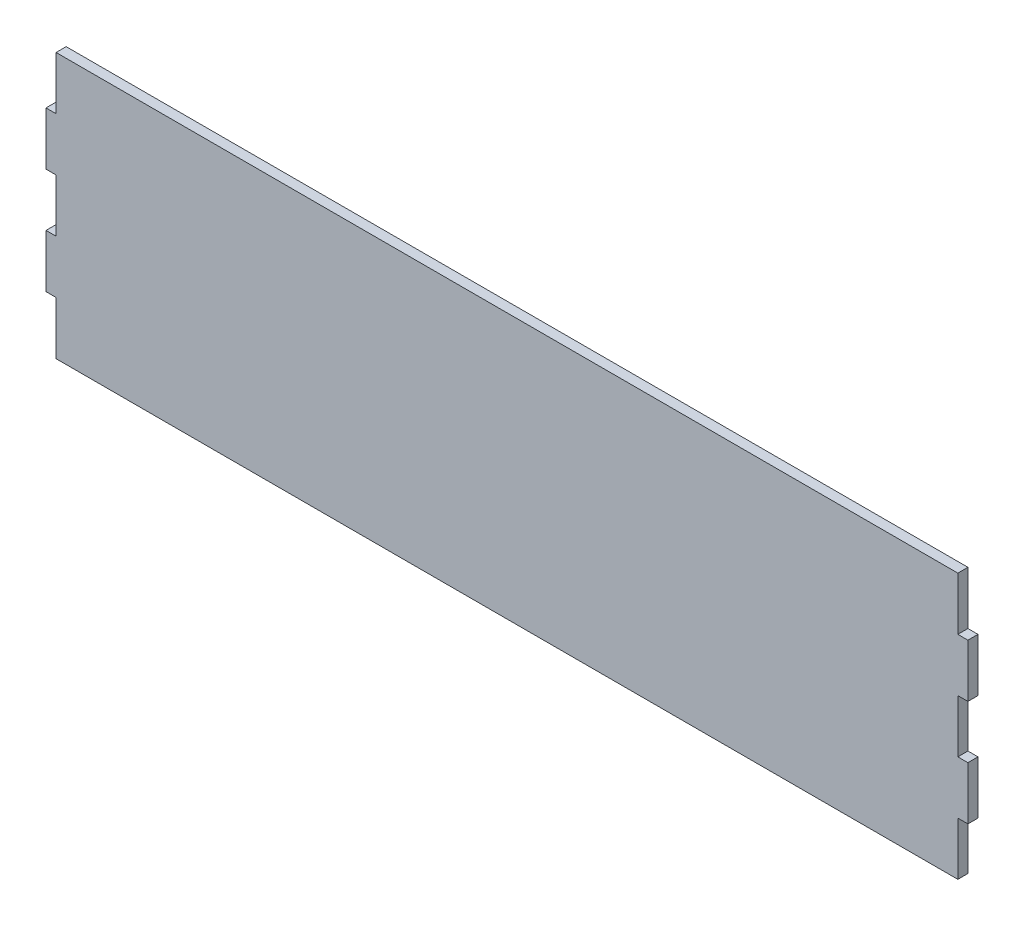
ISO-10303-21;
HEADER;
FILE_DESCRIPTION(('STEP AP214'),'2;1');
FILE_NAME('part.step','',(''),(''),'','','');
FILE_SCHEMA(('AUTOMOTIVE_DESIGN { 1 0 10303 214 1 1 1 1 }'));
ENDSEC;
DATA;
#1=APPLICATION_CONTEXT('core data for automotive mechanical design processes');
#2=APPLICATION_PROTOCOL_DEFINITION('international standard','automotive_design',2000,#1);
#3=PRODUCT_CONTEXT('',#1,'mechanical');
#4=PRODUCT('Part','Part','',(#3));
#5=PRODUCT_RELATED_PRODUCT_CATEGORY('part','',(#4));
#6=PRODUCT_DEFINITION_FORMATION('','',#4);
#7=PRODUCT_DEFINITION_CONTEXT('part definition',#1,'design');
#8=PRODUCT_DEFINITION('design','',#6,#7);
#9=PRODUCT_DEFINITION_SHAPE('','',#8);
#10=(LENGTH_UNIT() NAMED_UNIT(*) SI_UNIT(.MILLI.,.METRE.));
#11=(NAMED_UNIT(*) PLANE_ANGLE_UNIT() SI_UNIT($,.RADIAN.));
#12=(NAMED_UNIT(*) SI_UNIT($,.STERADIAN.) SOLID_ANGLE_UNIT());
#13=UNCERTAINTY_MEASURE_WITH_UNIT(LENGTH_MEASURE(1.E-05),#10,'distance_accuracy_value','');
#14=(GEOMETRIC_REPRESENTATION_CONTEXT(3) GLOBAL_UNCERTAINTY_ASSIGNED_CONTEXT((#13)) GLOBAL_UNIT_ASSIGNED_CONTEXT((#10,
#11,#12)) REPRESENTATION_CONTEXT('',''));
#15=CARTESIAN_POINT('',(0.,0.,0.));
#16=DIRECTION('',(0.,0.,1.));
#17=DIRECTION('',(1.,0.,0.));
#18=AXIS2_PLACEMENT_3D('',#15,#16,#17);
#19=CARTESIAN_POINT('',(0.,127.,4.826));
#20=DIRECTION('',(1.,0.,0.));
#21=DIRECTION('',(0.,0.,-1.));
#22=AXIS2_PLACEMENT_3D('',#19,#20,#21);
#23=PLANE('',#22);
#24=DIRECTION('',(0.,-1.,0.));
#25=VECTOR('',#24,1.);
#26=CARTESIAN_POINT('',(0.,127.,0.));
#27=LINE('',#26,#25);
#28=CARTESIAN_POINT('',(0.,127.,0.));
#29=VERTEX_POINT('',#28);
#30=CARTESIAN_POINT('',(0.,101.6,0.));
#31=VERTEX_POINT('',#30);
#32=EDGE_CURVE('E203',#29,#31,#27,.T.);
#33=ORIENTED_EDGE('',*,*,#32,.T.);
#34=DIRECTION('',(0.,0.,-1.));
#35=VECTOR('',#34,1.);
#36=CARTESIAN_POINT('',(0.,101.6,4.826));
#37=LINE('',#36,#35);
#38=CARTESIAN_POINT('',(0.,101.6,4.826));
#39=VERTEX_POINT('',#38);
#40=EDGE_CURVE('E11',#39,#31,#37,.T.);
#41=ORIENTED_EDGE('',*,*,#40,.F.);
#42=DIRECTION('',(0.,-1.,0.));
#43=VECTOR('',#42,1.);
#44=CARTESIAN_POINT('',(0.,127.,4.826));
#45=LINE('',#44,#43);
#46=CARTESIAN_POINT('',(0.,127.,4.826));
#47=VERTEX_POINT('',#46);
#48=EDGE_CURVE('E241',#47,#39,#45,.T.);
#49=ORIENTED_EDGE('',*,*,#48,.F.);
#50=DIRECTION('',(0.,0.,-1.));
#51=VECTOR('',#50,1.);
#52=CARTESIAN_POINT('',(0.,127.,4.826));
#53=LINE('',#52,#51);
#54=EDGE_CURVE('E199',#47,#29,#53,.T.);
#55=ORIENTED_EDGE('',*,*,#54,.T.);
#56=EDGE_LOOP('',(#33,#41,#49,#55));
#57=FACE_BOUND('',#56,.T.);
#58=ADVANCED_FACE('F35',(#57),#23,.F.);
#59=CARTESIAN_POINT('',(0.,101.6,4.826));
#60=DIRECTION('',(0.,-1.,0.));
#61=DIRECTION('',(1.,0.,0.));
#62=AXIS2_PLACEMENT_3D('',#59,#60,#61);
#63=PLANE('',#62);
#64=DIRECTION('',(-1.,0.,0.));
#65=VECTOR('',#64,1.);
#66=CARTESIAN_POINT('',(0.,101.6,0.));
#67=LINE('',#66,#65);
#68=CARTESIAN_POINT('',(-4.826,101.6,0.));
#69=VERTEX_POINT('',#68);
#70=EDGE_CURVE('E206',#31,#69,#67,.T.);
#71=ORIENTED_EDGE('',*,*,#70,.T.);
#72=DIRECTION('',(0.,0.,-1.));
#73=VECTOR('',#72,1.);
#74=CARTESIAN_POINT('',(-4.826,101.6,4.826));
#75=LINE('',#74,#73);
#76=CARTESIAN_POINT('',(-4.826,101.6,4.826));
#77=VERTEX_POINT('',#76);
#78=EDGE_CURVE('E43',#77,#69,#75,.T.);
#79=ORIENTED_EDGE('',*,*,#78,.F.);
#80=DIRECTION('',(-1.,0.,0.));
#81=VECTOR('',#80,1.);
#82=CARTESIAN_POINT('',(0.,101.6,4.826));
#83=LINE('',#82,#81);
#84=EDGE_CURVE('E130',#39,#77,#83,.T.);
#85=ORIENTED_EDGE('',*,*,#84,.F.);
#86=ORIENTED_EDGE('',*,*,#40,.T.);
#87=EDGE_LOOP('',(#71,#79,#85,#86));
#88=FACE_BOUND('',#87,.T.);
#89=ADVANCED_FACE('F359',(#88),#63,.F.);
#90=CARTESIAN_POINT('',(-4.826,101.6,4.826));
#91=DIRECTION('',(1.,0.,0.));
#92=DIRECTION('',(0.,1.,0.));
#93=AXIS2_PLACEMENT_3D('',#90,#91,#92);
#94=PLANE('',#93);
#95=DIRECTION('',(0.,-1.,0.));
#96=VECTOR('',#95,1.);
#97=CARTESIAN_POINT('',(-4.826,101.6,0.));
#98=LINE('',#97,#96);
#99=CARTESIAN_POINT('',(-4.826,76.2,0.));
#100=VERTEX_POINT('',#99);
#101=EDGE_CURVE('E208',#69,#100,#98,.T.);
#102=ORIENTED_EDGE('',*,*,#101,.T.);
#103=DIRECTION('',(0.,0.,-1.));
#104=VECTOR('',#103,1.);
#105=CARTESIAN_POINT('',(-4.826,76.2,4.826));
#106=LINE('',#105,#104);
#107=CARTESIAN_POINT('',(-4.826,76.2,4.826));
#108=VERTEX_POINT('',#107);
#109=EDGE_CURVE('E284',#108,#100,#106,.T.);
#110=ORIENTED_EDGE('',*,*,#109,.F.);
#111=DIRECTION('',(0.,-1.,0.));
#112=VECTOR('',#111,1.);
#113=CARTESIAN_POINT('',(-4.826,101.6,4.826));
#114=LINE('',#113,#112);
#115=EDGE_CURVE('E292',#77,#108,#114,.T.);
#116=ORIENTED_EDGE('',*,*,#115,.F.);
#117=ORIENTED_EDGE('',*,*,#78,.T.);
#118=EDGE_LOOP('',(#102,#110,#116,#117));
#119=FACE_BOUND('',#118,.T.);
#120=ADVANCED_FACE('F290',(#119),#94,.F.);
#121=CARTESIAN_POINT('',(0.,76.2,4.826));
#122=DIRECTION('',(0.,1.,0.));
#123=DIRECTION('',(0.,0.,1.));
#124=AXIS2_PLACEMENT_3D('',#121,#122,#123);
#125=PLANE('',#124);
#126=DIRECTION('',(1.,0.,0.));
#127=VECTOR('',#126,1.);
#128=CARTESIAN_POINT('',(0.,76.2,0.));
#129=LINE('',#128,#127);
#130=CARTESIAN_POINT('',(0.,76.2,0.));
#131=VERTEX_POINT('',#130);
#132=EDGE_CURVE('E210',#100,#131,#129,.T.);
#133=ORIENTED_EDGE('',*,*,#132,.T.);
#134=DIRECTION('',(0.,0.,-1.));
#135=VECTOR('',#134,1.);
#136=CARTESIAN_POINT('',(0.,76.2,4.826));
#137=LINE('',#136,#135);
#138=CARTESIAN_POINT('',(0.,76.2,4.826));
#139=VERTEX_POINT('',#138);
#140=EDGE_CURVE('E281',#139,#131,#137,.T.);
#141=ORIENTED_EDGE('',*,*,#140,.F.);
#142=DIRECTION('',(1.,0.,0.));
#143=VECTOR('',#142,1.);
#144=CARTESIAN_POINT('',(0.,76.2,4.826));
#145=LINE('',#144,#143);
#146=EDGE_CURVE('E310',#108,#139,#145,.T.);
#147=ORIENTED_EDGE('',*,*,#146,.F.);
#148=ORIENTED_EDGE('',*,*,#109,.T.);
#149=EDGE_LOOP('',(#133,#141,#147,#148));
#150=FACE_BOUND('',#149,.T.);
#151=ADVANCED_FACE('F301',(#150),#125,.F.);
#152=CARTESIAN_POINT('',(0.,76.2,4.826));
#153=DIRECTION('',(1.,0.,0.));
#154=DIRECTION('',(0.,0.,-1.));
#155=AXIS2_PLACEMENT_3D('',#152,#153,#154);
#156=PLANE('',#155);
#157=DIRECTION('',(0.,-1.,0.));
#158=VECTOR('',#157,1.);
#159=CARTESIAN_POINT('',(0.,76.2,0.));
#160=LINE('',#159,#158);
#161=CARTESIAN_POINT('',(0.,50.8,0.));
#162=VERTEX_POINT('',#161);
#163=EDGE_CURVE('E212',#131,#162,#160,.T.);
#164=ORIENTED_EDGE('',*,*,#163,.T.);
#165=DIRECTION('',(0.,0.,-1.));
#166=VECTOR('',#165,1.);
#167=CARTESIAN_POINT('',(0.,50.8,4.826));
#168=LINE('',#167,#166);
#169=CARTESIAN_POINT('',(0.,50.8,4.826));
#170=VERTEX_POINT('',#169);
#171=EDGE_CURVE('E278',#170,#162,#168,.T.);
#172=ORIENTED_EDGE('',*,*,#171,.F.);
#173=DIRECTION('',(0.,-1.,0.));
#174=VECTOR('',#173,1.);
#175=CARTESIAN_POINT('',(0.,76.2,4.826));
#176=LINE('',#175,#174);
#177=EDGE_CURVE('E307',#139,#170,#176,.T.);
#178=ORIENTED_EDGE('',*,*,#177,.F.);
#179=ORIENTED_EDGE('',*,*,#140,.T.);
#180=EDGE_LOOP('',(#164,#172,#178,#179));
#181=FACE_BOUND('',#180,.T.);
#182=ADVANCED_FACE('F305',(#181),#156,.F.);
#183=CARTESIAN_POINT('',(0.,50.8,4.826));
#184=DIRECTION('',(0.,-1.,0.));
#185=DIRECTION('',(0.,0.,-1.));
#186=AXIS2_PLACEMENT_3D('',#183,#184,#185);
#187=PLANE('',#186);
#188=DIRECTION('',(-1.,0.,0.));
#189=VECTOR('',#188,1.);
#190=CARTESIAN_POINT('',(0.,50.8,0.));
#191=LINE('',#190,#189);
#192=CARTESIAN_POINT('',(-4.826,50.8,0.));
#193=VERTEX_POINT('',#192);
#194=EDGE_CURVE('E214',#162,#193,#191,.T.);
#195=ORIENTED_EDGE('',*,*,#194,.T.);
#196=DIRECTION('',(0.,0.,-1.));
#197=VECTOR('',#196,1.);
#198=CARTESIAN_POINT('',(-4.826,50.8,4.826));
#199=LINE('',#198,#197);
#200=CARTESIAN_POINT('',(-4.826,50.8,4.826));
#201=VERTEX_POINT('',#200);
#202=EDGE_CURVE('E275',#201,#193,#199,.T.);
#203=ORIENTED_EDGE('',*,*,#202,.F.);
#204=DIRECTION('',(-1.,0.,0.));
#205=VECTOR('',#204,1.);
#206=CARTESIAN_POINT('',(0.,50.8,4.826));
#207=LINE('',#206,#205);
#208=EDGE_CURVE('E309',#170,#201,#207,.T.);
#209=ORIENTED_EDGE('',*,*,#208,.F.);
#210=ORIENTED_EDGE('',*,*,#171,.T.);
#211=EDGE_LOOP('',(#195,#203,#209,#210));
#212=FACE_BOUND('',#211,.T.);
#213=ADVANCED_FACE('F372',(#212),#187,.F.);
#214=CARTESIAN_POINT('',(-4.826,50.8,4.826));
#215=DIRECTION('',(1.,0.,0.));
#216=DIRECTION('',(0.,0.,-1.));
#217=AXIS2_PLACEMENT_3D('',#214,#215,#216);
#218=PLANE('',#217);
#219=DIRECTION('',(0.,-1.,0.));
#220=VECTOR('',#219,1.);
#221=CARTESIAN_POINT('',(-4.826,50.8,0.));
#222=LINE('',#221,#220);
#223=CARTESIAN_POINT('',(-4.826,25.4,0.));
#224=VERTEX_POINT('',#223);
#225=EDGE_CURVE('E216',#193,#224,#222,.T.);
#226=ORIENTED_EDGE('',*,*,#225,.T.);
#227=DIRECTION('',(0.,0.,-1.));
#228=VECTOR('',#227,1.);
#229=CARTESIAN_POINT('',(-4.826,25.4,4.826));
#230=LINE('',#229,#228);
#231=CARTESIAN_POINT('',(-4.826,25.4,4.826));
#232=VERTEX_POINT('',#231);
#233=EDGE_CURVE('E272',#232,#224,#230,.T.);
#234=ORIENTED_EDGE('',*,*,#233,.F.);
#235=DIRECTION('',(0.,-1.,0.));
#236=VECTOR('',#235,1.);
#237=CARTESIAN_POINT('',(-4.826,50.8,4.826));
#238=LINE('',#237,#236);
#239=EDGE_CURVE('E312',#201,#232,#238,.T.);
#240=ORIENTED_EDGE('',*,*,#239,.F.);
#241=ORIENTED_EDGE('',*,*,#202,.T.);
#242=EDGE_LOOP('',(#226,#234,#240,#241));
#243=FACE_BOUND('',#242,.T.);
#244=ADVANCED_FACE('F375',(#243),#218,.F.);
#245=CARTESIAN_POINT('',(0.,25.4,4.826));
#246=DIRECTION('',(0.,1.,0.));
#247=DIRECTION('',(-1.,0.,0.));
#248=AXIS2_PLACEMENT_3D('',#245,#246,#247);
#249=PLANE('',#248);
#250=DIRECTION('',(1.,0.,0.));
#251=VECTOR('',#250,1.);
#252=CARTESIAN_POINT('',(0.,25.4,0.));
#253=LINE('',#252,#251);
#254=CARTESIAN_POINT('',(0.,25.4,0.));
#255=VERTEX_POINT('',#254);
#256=EDGE_CURVE('E218',#224,#255,#253,.T.);
#257=ORIENTED_EDGE('',*,*,#256,.T.);
#258=DIRECTION('',(0.,0.,-1.));
#259=VECTOR('',#258,1.);
#260=CARTESIAN_POINT('',(0.,25.4,4.826));
#261=LINE('',#260,#259);
#262=CARTESIAN_POINT('',(0.,25.4,4.826));
#263=VERTEX_POINT('',#262);
#264=EDGE_CURVE('E269',#263,#255,#261,.T.);
#265=ORIENTED_EDGE('',*,*,#264,.F.);
#266=DIRECTION('',(1.,0.,0.));
#267=VECTOR('',#266,1.);
#268=CARTESIAN_POINT('',(0.,25.4,4.826));
#269=LINE('',#268,#267);
#270=EDGE_CURVE('E318',#232,#263,#269,.T.);
#271=ORIENTED_EDGE('',*,*,#270,.F.);
#272=ORIENTED_EDGE('',*,*,#233,.T.);
#273=EDGE_LOOP('',(#257,#265,#271,#272));
#274=FACE_BOUND('',#273,.T.);
#275=ADVANCED_FACE('F379',(#274),#249,.F.);
#276=CARTESIAN_POINT('',(0.,25.4,4.826));
#277=DIRECTION('',(1.,0.,0.));
#278=DIRECTION('',(0.,0.,-1.));
#279=AXIS2_PLACEMENT_3D('',#276,#277,#278);
#280=PLANE('',#279);
#281=DIRECTION('',(0.,-1.,0.));
#282=VECTOR('',#281,1.);
#283=CARTESIAN_POINT('',(0.,25.4,0.));
#284=LINE('',#283,#282);
#285=CARTESIAN_POINT('',(0.,0.,0.));
#286=VERTEX_POINT('',#285);
#287=EDGE_CURVE('E220',#255,#286,#284,.T.);
#288=ORIENTED_EDGE('',*,*,#287,.T.);
#289=DIRECTION('',(0.,0.,-1.));
#290=VECTOR('',#289,1.);
#291=CARTESIAN_POINT('',(0.,0.,4.826));
#292=LINE('',#291,#290);
#293=CARTESIAN_POINT('',(0.,0.,4.826));
#294=VERTEX_POINT('',#293);
#295=EDGE_CURVE('E266',#294,#286,#292,.T.);
#296=ORIENTED_EDGE('',*,*,#295,.F.);
#297=DIRECTION('',(0.,-1.,0.));
#298=VECTOR('',#297,1.);
#299=CARTESIAN_POINT('',(0.,25.4,4.826));
#300=LINE('',#299,#298);
#301=EDGE_CURVE('E320',#263,#294,#300,.T.);
#302=ORIENTED_EDGE('',*,*,#301,.F.);
#303=ORIENTED_EDGE('',*,*,#264,.T.);
#304=EDGE_LOOP('',(#288,#296,#302,#303));
#305=FACE_BOUND('',#304,.T.);
#306=ADVANCED_FACE('F383',(#305),#280,.F.);
#307=CARTESIAN_POINT('',(0.,0.,4.826));
#308=DIRECTION('',(0.,1.,0.));
#309=DIRECTION('',(0.,0.,1.));
#310=AXIS2_PLACEMENT_3D('',#307,#308,#309);
#311=PLANE('',#310);
#312=DIRECTION('',(1.,0.,0.));
#313=VECTOR('',#312,1.);
#314=CARTESIAN_POINT('',(0.,0.,0.));
#315=LINE('',#314,#313);
#316=CARTESIAN_POINT('',(431.8,0.,0.));
#317=VERTEX_POINT('',#316);
#318=EDGE_CURVE('E222',#286,#317,#315,.T.);
#319=ORIENTED_EDGE('',*,*,#318,.T.);
#320=DIRECTION('',(0.,0.,-1.));
#321=VECTOR('',#320,1.);
#322=CARTESIAN_POINT('',(431.8,0.,4.826));
#323=LINE('',#322,#321);
#324=CARTESIAN_POINT('',(431.8,0.,4.826));
#325=VERTEX_POINT('',#324);
#326=EDGE_CURVE('E263',#325,#317,#323,.T.);
#327=ORIENTED_EDGE('',*,*,#326,.F.);
#328=DIRECTION('',(1.,0.,0.));
#329=VECTOR('',#328,1.);
#330=CARTESIAN_POINT('',(0.,0.,4.826));
#331=LINE('',#330,#329);
#332=EDGE_CURVE('E322',#294,#325,#331,.T.);
#333=ORIENTED_EDGE('',*,*,#332,.F.);
#334=ORIENTED_EDGE('',*,*,#295,.T.);
#335=EDGE_LOOP('',(#319,#327,#333,#334));
#336=FACE_BOUND('',#335,.T.);
#337=ADVANCED_FACE('F387',(#336),#311,.F.);
#338=CARTESIAN_POINT('',(431.8,25.4,4.826));
#339=DIRECTION('',(-1.,0.,0.));
#340=DIRECTION('',(0.,0.,1.));
#341=AXIS2_PLACEMENT_3D('',#338,#339,#340);
#342=PLANE('',#341);
#343=DIRECTION('',(0.,1.,0.));
#344=VECTOR('',#343,1.);
#345=CARTESIAN_POINT('',(431.8,25.4,0.));
#346=LINE('',#345,#344);
#347=CARTESIAN_POINT('',(431.8,25.4,0.));
#348=VERTEX_POINT('',#347);
#349=EDGE_CURVE('E224',#317,#348,#346,.T.);
#350=ORIENTED_EDGE('',*,*,#349,.T.);
#351=DIRECTION('',(0.,0.,-1.));
#352=VECTOR('',#351,1.);
#353=CARTESIAN_POINT('',(431.8,25.4,4.826));
#354=LINE('',#353,#352);
#355=CARTESIAN_POINT('',(431.8,25.4,4.826));
#356=VERTEX_POINT('',#355);
#357=EDGE_CURVE('E260',#356,#348,#354,.T.);
#358=ORIENTED_EDGE('',*,*,#357,.F.);
#359=DIRECTION('',(0.,1.,0.));
#360=VECTOR('',#359,1.);
#361=CARTESIAN_POINT('',(431.8,25.4,4.826));
#362=LINE('',#361,#360);
#363=EDGE_CURVE('E324',#325,#356,#362,.T.);
#364=ORIENTED_EDGE('',*,*,#363,.F.);
#365=ORIENTED_EDGE('',*,*,#326,.T.);
#366=EDGE_LOOP('',(#350,#358,#364,#365));
#367=FACE_BOUND('',#366,.T.);
#368=ADVANCED_FACE('F391',(#367),#342,.F.);
#369=CARTESIAN_POINT('',(431.8,25.4,4.826));
#370=DIRECTION('',(0.,1.,0.));
#371=DIRECTION('',(-1.,0.,0.));
#372=AXIS2_PLACEMENT_3D('',#369,#370,#371);
#373=PLANE('',#372);
#374=DIRECTION('',(1.,0.,0.));
#375=VECTOR('',#374,1.);
#376=CARTESIAN_POINT('',(431.8,25.4,0.));
#377=LINE('',#376,#375);
#378=CARTESIAN_POINT('',(436.626,25.4,0.));
#379=VERTEX_POINT('',#378);
#380=EDGE_CURVE('E226',#348,#379,#377,.T.);
#381=ORIENTED_EDGE('',*,*,#380,.T.);
#382=DIRECTION('',(0.,0.,-1.));
#383=VECTOR('',#382,1.);
#384=CARTESIAN_POINT('',(436.626,25.4,4.826));
#385=LINE('',#384,#383);
#386=CARTESIAN_POINT('',(436.626,25.4,4.826));
#387=VERTEX_POINT('',#386);
#388=EDGE_CURVE('E257',#387,#379,#385,.T.);
#389=ORIENTED_EDGE('',*,*,#388,.F.);
#390=DIRECTION('',(1.,0.,0.));
#391=VECTOR('',#390,1.);
#392=CARTESIAN_POINT('',(431.8,25.4,4.826));
#393=LINE('',#392,#391);
#394=EDGE_CURVE('E326',#356,#387,#393,.T.);
#395=ORIENTED_EDGE('',*,*,#394,.F.);
#396=ORIENTED_EDGE('',*,*,#357,.T.);
#397=EDGE_LOOP('',(#381,#389,#395,#396));
#398=FACE_BOUND('',#397,.T.);
#399=ADVANCED_FACE('F395',(#398),#373,.F.);
#400=CARTESIAN_POINT('',(436.626,50.8,4.826));
#401=DIRECTION('',(-1.,0.,0.));
#402=DIRECTION('',(0.,0.,1.));
#403=AXIS2_PLACEMENT_3D('',#400,#401,#402);
#404=PLANE('',#403);
#405=DIRECTION('',(0.,1.,0.));
#406=VECTOR('',#405,1.);
#407=CARTESIAN_POINT('',(436.626,50.8,0.));
#408=LINE('',#407,#406);
#409=CARTESIAN_POINT('',(436.626,50.8,0.));
#410=VERTEX_POINT('',#409);
#411=EDGE_CURVE('E228',#379,#410,#408,.T.);
#412=ORIENTED_EDGE('',*,*,#411,.T.);
#413=DIRECTION('',(0.,0.,-1.));
#414=VECTOR('',#413,1.);
#415=CARTESIAN_POINT('',(436.626,50.8,4.826));
#416=LINE('',#415,#414);
#417=CARTESIAN_POINT('',(436.626,50.8,4.826));
#418=VERTEX_POINT('',#417);
#419=EDGE_CURVE('E254',#418,#410,#416,.T.);
#420=ORIENTED_EDGE('',*,*,#419,.F.);
#421=DIRECTION('',(0.,1.,0.));
#422=VECTOR('',#421,1.);
#423=CARTESIAN_POINT('',(436.626,50.8,4.826));
#424=LINE('',#423,#422);
#425=EDGE_CURVE('E328',#387,#418,#424,.T.);
#426=ORIENTED_EDGE('',*,*,#425,.F.);
#427=ORIENTED_EDGE('',*,*,#388,.T.);
#428=EDGE_LOOP('',(#412,#420,#426,#427));
#429=FACE_BOUND('',#428,.T.);
#430=ADVANCED_FACE('F399',(#429),#404,.F.);
#431=CARTESIAN_POINT('',(431.8,50.8,4.826));
#432=DIRECTION('',(0.,-1.,0.));
#433=DIRECTION('',(0.,0.,-1.));
#434=AXIS2_PLACEMENT_3D('',#431,#432,#433);
#435=PLANE('',#434);
#436=DIRECTION('',(-1.,0.,0.));
#437=VECTOR('',#436,1.);
#438=CARTESIAN_POINT('',(431.8,50.8,0.));
#439=LINE('',#438,#437);
#440=CARTESIAN_POINT('',(431.8,50.8,0.));
#441=VERTEX_POINT('',#440);
#442=EDGE_CURVE('E230',#410,#441,#439,.T.);
#443=ORIENTED_EDGE('',*,*,#442,.T.);
#444=DIRECTION('',(0.,0.,-1.));
#445=VECTOR('',#444,1.);
#446=CARTESIAN_POINT('',(431.8,50.8,4.826));
#447=LINE('',#446,#445);
#448=CARTESIAN_POINT('',(431.8,50.8,4.826));
#449=VERTEX_POINT('',#448);
#450=EDGE_CURVE('E251',#449,#441,#447,.T.);
#451=ORIENTED_EDGE('',*,*,#450,.F.);
#452=DIRECTION('',(-1.,0.,0.));
#453=VECTOR('',#452,1.);
#454=CARTESIAN_POINT('',(431.8,50.8,4.826));
#455=LINE('',#454,#453);
#456=EDGE_CURVE('E330',#418,#449,#455,.T.);
#457=ORIENTED_EDGE('',*,*,#456,.F.);
#458=ORIENTED_EDGE('',*,*,#419,.T.);
#459=EDGE_LOOP('',(#443,#451,#457,#458));
#460=FACE_BOUND('',#459,.T.);
#461=ADVANCED_FACE('F403',(#460),#435,.F.);
#462=CARTESIAN_POINT('',(431.8,76.2,4.826));
#463=DIRECTION('',(-1.,0.,0.));
#464=DIRECTION('',(0.,0.,1.));
#465=AXIS2_PLACEMENT_3D('',#462,#463,#464);
#466=PLANE('',#465);
#467=DIRECTION('',(0.,1.,0.));
#468=VECTOR('',#467,1.);
#469=CARTESIAN_POINT('',(431.8,76.2,0.));
#470=LINE('',#469,#468);
#471=CARTESIAN_POINT('',(431.8,76.2,0.));
#472=VERTEX_POINT('',#471);
#473=EDGE_CURVE('E232',#441,#472,#470,.T.);
#474=ORIENTED_EDGE('',*,*,#473,.T.);
#475=DIRECTION('',(0.,0.,-1.));
#476=VECTOR('',#475,1.);
#477=CARTESIAN_POINT('',(431.8,76.2,4.826));
#478=LINE('',#477,#476);
#479=CARTESIAN_POINT('',(431.8,76.2,4.826));
#480=VERTEX_POINT('',#479);
#481=EDGE_CURVE('E248',#480,#472,#478,.T.);
#482=ORIENTED_EDGE('',*,*,#481,.F.);
#483=DIRECTION('',(0.,1.,0.));
#484=VECTOR('',#483,1.);
#485=CARTESIAN_POINT('',(431.8,76.2,4.826));
#486=LINE('',#485,#484);
#487=EDGE_CURVE('E332',#449,#480,#486,.T.);
#488=ORIENTED_EDGE('',*,*,#487,.F.);
#489=ORIENTED_EDGE('',*,*,#450,.T.);
#490=EDGE_LOOP('',(#474,#482,#488,#489));
#491=FACE_BOUND('',#490,.T.);
#492=ADVANCED_FACE('F407',(#491),#466,.F.);
#493=CARTESIAN_POINT('',(431.8,76.2,4.826));
#494=DIRECTION('',(0.,1.,0.));
#495=DIRECTION('',(0.,0.,1.));
#496=AXIS2_PLACEMENT_3D('',#493,#494,#495);
#497=PLANE('',#496);
#498=DIRECTION('',(1.,0.,0.));
#499=VECTOR('',#498,1.);
#500=CARTESIAN_POINT('',(431.8,76.2,0.));
#501=LINE('',#500,#499);
#502=CARTESIAN_POINT('',(436.626,76.2,0.));
#503=VERTEX_POINT('',#502);
#504=EDGE_CURVE('E234',#472,#503,#501,.T.);
#505=ORIENTED_EDGE('',*,*,#504,.T.);
#506=DIRECTION('',(0.,0.,-1.));
#507=VECTOR('',#506,1.);
#508=CARTESIAN_POINT('',(436.626,76.2,4.826));
#509=LINE('',#508,#507);
#510=CARTESIAN_POINT('',(436.626,76.2,4.826));
#511=VERTEX_POINT('',#510);
#512=EDGE_CURVE('E245',#511,#503,#509,.T.);
#513=ORIENTED_EDGE('',*,*,#512,.F.);
#514=DIRECTION('',(1.,0.,0.));
#515=VECTOR('',#514,1.);
#516=CARTESIAN_POINT('',(431.8,76.2,4.826));
#517=LINE('',#516,#515);
#518=EDGE_CURVE('E334',#480,#511,#517,.T.);
#519=ORIENTED_EDGE('',*,*,#518,.F.);
#520=ORIENTED_EDGE('',*,*,#481,.T.);
#521=EDGE_LOOP('',(#505,#513,#519,#520));
#522=FACE_BOUND('',#521,.T.);
#523=ADVANCED_FACE('F340',(#522),#497,.F.);
#524=CARTESIAN_POINT('',(436.626,101.6,4.826));
#525=DIRECTION('',(-1.,0.,0.));
#526=DIRECTION('',(0.,0.,1.));
#527=AXIS2_PLACEMENT_3D('',#524,#525,#526);
#528=PLANE('',#527);
#529=DIRECTION('',(0.,1.,0.));
#530=VECTOR('',#529,1.);
#531=CARTESIAN_POINT('',(436.626,101.6,0.));
#532=LINE('',#531,#530);
#533=CARTESIAN_POINT('',(436.626,101.6,0.));
#534=VERTEX_POINT('',#533);
#535=EDGE_CURVE('E236',#503,#534,#532,.T.);
#536=ORIENTED_EDGE('',*,*,#535,.T.);
#537=DIRECTION('',(0.,0.,-1.));
#538=VECTOR('',#537,1.);
#539=CARTESIAN_POINT('',(436.626,101.6,4.826));
#540=LINE('',#539,#538);
#541=CARTESIAN_POINT('',(436.626,101.6,4.826));
#542=VERTEX_POINT('',#541);
#543=EDGE_CURVE('E194',#542,#534,#540,.T.);
#544=ORIENTED_EDGE('',*,*,#543,.F.);
#545=DIRECTION('',(0.,1.,0.));
#546=VECTOR('',#545,1.);
#547=CARTESIAN_POINT('',(436.626,101.6,4.826));
#548=LINE('',#547,#546);
#549=EDGE_CURVE('E185',#511,#542,#548,.T.);
#550=ORIENTED_EDGE('',*,*,#549,.F.);
#551=ORIENTED_EDGE('',*,*,#512,.T.);
#552=EDGE_LOOP('',(#536,#544,#550,#551));
#553=FACE_BOUND('',#552,.T.);
#554=ADVANCED_FACE('F344',(#553),#528,.F.);
#555=CARTESIAN_POINT('',(431.8,101.6,4.826));
#556=DIRECTION('',(0.,-1.,0.));
#557=DIRECTION('',(1.,0.,0.));
#558=AXIS2_PLACEMENT_3D('',#555,#556,#557);
#559=PLANE('',#558);
#560=DIRECTION('',(-1.,0.,0.));
#561=VECTOR('',#560,1.);
#562=CARTESIAN_POINT('',(431.8,101.6,0.));
#563=LINE('',#562,#561);
#564=CARTESIAN_POINT('',(431.8,101.6,0.));
#565=VERTEX_POINT('',#564);
#566=EDGE_CURVE('E193',#534,#565,#563,.T.);
#567=ORIENTED_EDGE('',*,*,#566,.T.);
#568=DIRECTION('',(0.,0.,-1.));
#569=VECTOR('',#568,1.);
#570=CARTESIAN_POINT('',(431.8,101.6,4.826));
#571=LINE('',#570,#569);
#572=CARTESIAN_POINT('',(431.8,101.6,4.826));
#573=VERTEX_POINT('',#572);
#574=EDGE_CURVE('E190',#573,#565,#571,.T.);
#575=ORIENTED_EDGE('',*,*,#574,.F.);
#576=DIRECTION('',(-1.,0.,0.));
#577=VECTOR('',#576,1.);
#578=CARTESIAN_POINT('',(431.8,101.6,4.826));
#579=LINE('',#578,#577);
#580=EDGE_CURVE('E179',#542,#573,#579,.T.);
#581=ORIENTED_EDGE('',*,*,#580,.F.);
#582=ORIENTED_EDGE('',*,*,#543,.T.);
#583=EDGE_LOOP('',(#567,#575,#581,#582));
#584=FACE_BOUND('',#583,.T.);
#585=ADVANCED_FACE('F191',(#584),#559,.F.);
#586=CARTESIAN_POINT('',(431.8,127.,4.826));
#587=DIRECTION('',(-1.,0.,0.));
#588=DIRECTION('',(0.,0.,1.));
#589=AXIS2_PLACEMENT_3D('',#586,#587,#588);
#590=PLANE('',#589);
#591=DIRECTION('',(0.,1.,0.));
#592=VECTOR('',#591,1.);
#593=CARTESIAN_POINT('',(431.8,127.,0.));
#594=LINE('',#593,#592);
#595=CARTESIAN_POINT('',(431.8,127.,0.));
#596=VERTEX_POINT('',#595);
#597=EDGE_CURVE('E116',#565,#596,#594,.T.);
#598=ORIENTED_EDGE('',*,*,#597,.T.);
#599=DIRECTION('',(0.,0.,-1.));
#600=VECTOR('',#599,1.);
#601=CARTESIAN_POINT('',(431.8,127.,4.826));
#602=LINE('',#601,#600);
#603=CARTESIAN_POINT('',(431.8,127.,4.826));
#604=VERTEX_POINT('',#603);
#605=EDGE_CURVE('E195',#604,#596,#602,.T.);
#606=ORIENTED_EDGE('',*,*,#605,.F.);
#607=DIRECTION('',(0.,1.,0.));
#608=VECTOR('',#607,1.);
#609=CARTESIAN_POINT('',(431.8,127.,4.826));
#610=LINE('',#609,#608);
#611=EDGE_CURVE('E183',#573,#604,#610,.T.);
#612=ORIENTED_EDGE('',*,*,#611,.F.);
#613=ORIENTED_EDGE('',*,*,#574,.T.);
#614=EDGE_LOOP('',(#598,#606,#612,#613));
#615=FACE_BOUND('',#614,.T.);
#616=ADVANCED_FACE('F197',(#615),#590,.F.);
#617=CARTESIAN_POINT('',(0.,127.,4.826));
#618=DIRECTION('',(0.,-1.,0.));
#619=DIRECTION('',(0.,0.,-1.));
#620=AXIS2_PLACEMENT_3D('',#617,#618,#619);
#621=PLANE('',#620);
#622=DIRECTION('',(-1.,0.,0.));
#623=VECTOR('',#622,1.);
#624=CARTESIAN_POINT('',(0.,127.,0.));
#625=LINE('',#624,#623);
#626=EDGE_CURVE('E122',#596,#29,#625,.T.);
#627=ORIENTED_EDGE('',*,*,#626,.T.);
#628=ORIENTED_EDGE('',*,*,#54,.F.);
#629=DIRECTION('',(-1.,0.,0.));
#630=VECTOR('',#629,1.);
#631=CARTESIAN_POINT('',(0.,127.,4.826));
#632=LINE('',#631,#630);
#633=EDGE_CURVE('E51',#604,#47,#632,.T.);
#634=ORIENTED_EDGE('',*,*,#633,.F.);
#635=ORIENTED_EDGE('',*,*,#605,.T.);
#636=EDGE_LOOP('',(#627,#628,#634,#635));
#637=FACE_BOUND('',#636,.T.);
#638=ADVANCED_FACE('F348',(#637),#621,.F.);
#639=CARTESIAN_POINT('',(0.,0.,4.826));
#640=DIRECTION('',(0.,0.,-1.));
#641=DIRECTION('',(-1.,0.,0.));
#642=AXIS2_PLACEMENT_3D('',#639,#640,#641);
#643=PLANE('',#642);
#644=ORIENTED_EDGE('',*,*,#48,.T.);
#645=ORIENTED_EDGE('',*,*,#84,.T.);
#646=ORIENTED_EDGE('',*,*,#115,.T.);
#647=ORIENTED_EDGE('',*,*,#146,.T.);
#648=ORIENTED_EDGE('',*,*,#177,.T.);
#649=ORIENTED_EDGE('',*,*,#208,.T.);
#650=ORIENTED_EDGE('',*,*,#239,.T.);
#651=ORIENTED_EDGE('',*,*,#270,.T.);
#652=ORIENTED_EDGE('',*,*,#301,.T.);
#653=ORIENTED_EDGE('',*,*,#332,.T.);
#654=ORIENTED_EDGE('',*,*,#363,.T.);
#655=ORIENTED_EDGE('',*,*,#394,.T.);
#656=ORIENTED_EDGE('',*,*,#425,.T.);
#657=ORIENTED_EDGE('',*,*,#456,.T.);
#658=ORIENTED_EDGE('',*,*,#487,.T.);
#659=ORIENTED_EDGE('',*,*,#518,.T.);
#660=ORIENTED_EDGE('',*,*,#549,.T.);
#661=ORIENTED_EDGE('',*,*,#580,.T.);
#662=ORIENTED_EDGE('',*,*,#611,.T.);
#663=ORIENTED_EDGE('',*,*,#633,.T.);
#664=EDGE_LOOP('',(#644,#645,#646,#647,#648,#649,#650,#651,#652,#653,#654,#655,#656,#657,#658,
#659,#660,#661,#662,#663));
#665=FACE_BOUND('',#664,.T.);
#666=ADVANCED_FACE('F181',(#665),#643,.F.);
#667=CARTESIAN_POINT('',(0.,0.,0.));
#668=DIRECTION('',(0.,0.,-1.));
#669=DIRECTION('',(-1.,0.,0.));
#670=AXIS2_PLACEMENT_3D('',#667,#668,#669);
#671=PLANE('',#670);
#672=ORIENTED_EDGE('',*,*,#32,.F.);
#673=ORIENTED_EDGE('',*,*,#626,.F.);
#674=ORIENTED_EDGE('',*,*,#597,.F.);
#675=ORIENTED_EDGE('',*,*,#566,.F.);
#676=ORIENTED_EDGE('',*,*,#535,.F.);
#677=ORIENTED_EDGE('',*,*,#504,.F.);
#678=ORIENTED_EDGE('',*,*,#473,.F.);
#679=ORIENTED_EDGE('',*,*,#442,.F.);
#680=ORIENTED_EDGE('',*,*,#411,.F.);
#681=ORIENTED_EDGE('',*,*,#380,.F.);
#682=ORIENTED_EDGE('',*,*,#349,.F.);
#683=ORIENTED_EDGE('',*,*,#318,.F.);
#684=ORIENTED_EDGE('',*,*,#287,.F.);
#685=ORIENTED_EDGE('',*,*,#256,.F.);
#686=ORIENTED_EDGE('',*,*,#225,.F.);
#687=ORIENTED_EDGE('',*,*,#194,.F.);
#688=ORIENTED_EDGE('',*,*,#163,.F.);
#689=ORIENTED_EDGE('',*,*,#132,.F.);
#690=ORIENTED_EDGE('',*,*,#101,.F.);
#691=ORIENTED_EDGE('',*,*,#70,.F.);
#692=EDGE_LOOP('',(#672,#673,#674,#675,#676,#677,#678,#679,#680,#681,#682,#683,#684,#685,#686,
#687,#688,#689,#690,#691));
#693=FACE_BOUND('',#692,.T.);
#694=ADVANCED_FACE('F296',(#693),#671,.T.);
#695=CLOSED_SHELL('',(#58,#89,#120,#151,#182,#213,#244,#275,#306,#337,#368,#399,#430,#461,#492,
#523,#554,#585,#616,#638,#666,#694));
#696=MANIFOLD_SOLID_BREP('B2',#695);
#697=ADVANCED_BREP_SHAPE_REPRESENTATION('',(#18,#696),#14);
#698=SHAPE_DEFINITION_REPRESENTATION(#9,#697);
ENDSEC;
END-ISO-10303-21;
